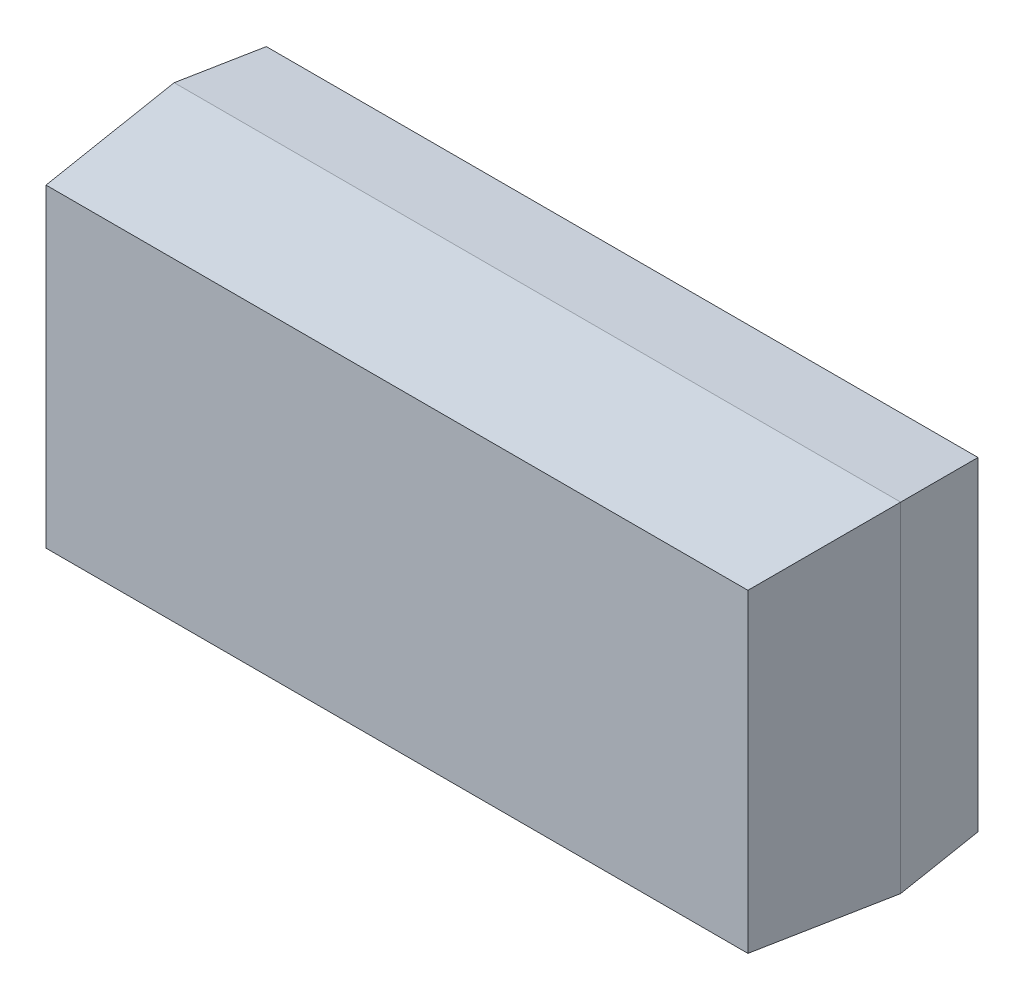
ISO-10303-21;
HEADER;
FILE_DESCRIPTION(('STEP AP214'),'2;1');
FILE_NAME('part.step','',(''),(''),'','','');
FILE_SCHEMA(('AUTOMOTIVE_DESIGN { 1 0 10303 214 1 1 1 1 }'));
ENDSEC;
DATA;
#1=APPLICATION_CONTEXT('core data for automotive mechanical design processes');
#2=APPLICATION_PROTOCOL_DEFINITION('international standard','automotive_design',2000,#1);
#3=PRODUCT_CONTEXT('',#1,'mechanical');
#4=PRODUCT('Part','Part','',(#3));
#5=PRODUCT_RELATED_PRODUCT_CATEGORY('part','',(#4));
#6=PRODUCT_DEFINITION_FORMATION('','',#4);
#7=PRODUCT_DEFINITION_CONTEXT('part definition',#1,'design');
#8=PRODUCT_DEFINITION('design','',#6,#7);
#9=PRODUCT_DEFINITION_SHAPE('','',#8);
#10=(LENGTH_UNIT() NAMED_UNIT(*) SI_UNIT(.MILLI.,.METRE.));
#11=(NAMED_UNIT(*) PLANE_ANGLE_UNIT() SI_UNIT($,.RADIAN.));
#12=(NAMED_UNIT(*) SI_UNIT($,.STERADIAN.) SOLID_ANGLE_UNIT());
#13=UNCERTAINTY_MEASURE_WITH_UNIT(LENGTH_MEASURE(1.E-05),#10,'distance_accuracy_value','');
#14=(GEOMETRIC_REPRESENTATION_CONTEXT(3) GLOBAL_UNCERTAINTY_ASSIGNED_CONTEXT((#13)) GLOBAL_UNIT_ASSIGNED_CONTEXT((#10,
#11,#12)) REPRESENTATION_CONTEXT('',''));
#15=CARTESIAN_POINT('',(0.,0.,0.));
#16=DIRECTION('',(0.,0.,1.));
#17=DIRECTION('',(1.,0.,0.));
#18=AXIS2_PLACEMENT_3D('',#15,#16,#17);
#19=CARTESIAN_POINT('',(0.0749003437265001,-0.478279018165759,0.109451736155931));
#20=DIRECTION('',(0.,0.,-1.));
#21=DIRECTION('',(0.,1.,0.));
#22=AXIS2_PLACEMENT_3D('',#19,#20,#21);
#23=PLANE('',#22);
#24=DIRECTION('',(0.,1.,0.));
#25=VECTOR('',#24,1.);
#26=CARTESIAN_POINT('',(0.194720769231439,-0.41984664680078,0.109451736155931));
#27=LINE('',#26,#25);
#28=CARTESIAN_POINT('',(0.194720769231439,-0.475722889917118,0.109451736155931));
#29=VERTEX_POINT('',#28);
#30=CARTESIAN_POINT('',(0.194720769231439,-0.424600324944285,0.109451736155931));
#31=VERTEX_POINT('',#30);
#32=EDGE_CURVE('E89',#29,#31,#27,.T.);
#33=ORIENTED_EDGE('',*,*,#32,.T.);
#34=DIRECTION('',(1.,0.,0.));
#35=VECTOR('',#34,1.);
#36=CARTESIAN_POINT('',(0.0727027938316369,-0.424600324944284,0.109451736155931));
#37=LINE('',#36,#35);
#38=CARTESIAN_POINT('',(0.0806060782743545,-0.424600324944285,0.109451736155931));
#39=VERTEX_POINT('',#38);
#40=EDGE_CURVE('E71',#31,#39,#37,.F.);
#41=ORIENTED_EDGE('',*,*,#40,.T.);
#42=DIRECTION('',(0.,1.,0.));
#43=VECTOR('',#42,1.);
#44=CARTESIAN_POINT('',(0.0806060782743545,-0.41984664680078,0.109451736155931));
#45=LINE('',#44,#43);
#46=CARTESIAN_POINT('',(0.0806060782743545,-0.475722889917118,0.109451736155931));
#47=VERTEX_POINT('',#46);
#48=EDGE_CURVE('E20',#39,#47,#45,.F.);
#49=ORIENTED_EDGE('',*,*,#48,.T.);
#50=DIRECTION('',(1.,0.,0.));
#51=VECTOR('',#50,1.);
#52=CARTESIAN_POINT('',(0.0727027938316369,-0.475722889917118,0.109451736155931));
#53=LINE('',#52,#51);
#54=EDGE_CURVE('E67',#47,#29,#53,.T.);
#55=ORIENTED_EDGE('',*,*,#54,.T.);
#56=EDGE_LOOP('',(#33,#41,#49,#55));
#57=FACE_BOUND('',#56,.T.);
#58=ADVANCED_FACE('F17',(#57),#23,.F.);
#59=CARTESIAN_POINT('',(0.0785084170110757,-0.41984664680078,0.0854753582031754));
#60=DIRECTION('',(0.996194698091746,0.,-0.0871557427476491));
#61=DIRECTION('',(-0.0871557427476491,0.,-0.996194698091746));
#62=AXIS2_PLACEMENT_3D('',#59,#60,#61);
#63=PLANE('',#62);
#64=DIRECTION('',(0.0868265938642344,0.0868265938642409,0.992432509138969));
#65=VECTOR('',#64,1.);
#66=CARTESIAN_POINT('',(0.0786083056426605,-0.477720662548812,0.08661709048664));
#67=LINE('',#66,#65);
#68=CARTESIAN_POINT('',(0.0786083056426604,-0.477720662548812,0.08661709048664));
#69=VERTEX_POINT('',#68);
#70=EDGE_CURVE('E76',#69,#47,#67,.T.);
#71=ORIENTED_EDGE('',*,*,#70,.T.);
#72=ORIENTED_EDGE('',*,*,#48,.F.);
#73=DIRECTION('',(-0.0868265938642344,0.0868265938642008,-0.992432509138972));
#74=VECTOR('',#73,1.);
#75=CARTESIAN_POINT('',(0.0806060782743545,-0.424600324944284,0.109451736155931));
#76=LINE('',#75,#74);
#77=CARTESIAN_POINT('',(0.0786083056426604,-0.422602552312591,0.08661709048664));
#78=VERTEX_POINT('',#77);
#79=EDGE_CURVE('E91',#39,#78,#76,.T.);
#80=ORIENTED_EDGE('',*,*,#79,.T.);
#81=DIRECTION('',(0.,1.,0.));
#82=VECTOR('',#81,1.);
#83=CARTESIAN_POINT('',(0.0786083056426603,-0.41984664680078,0.08661709048664));
#84=LINE('',#83,#82);
#85=EDGE_CURVE('E85',#78,#69,#84,.F.);
#86=ORIENTED_EDGE('',*,*,#85,.T.);
#87=EDGE_LOOP('',(#71,#72,#80,#86));
#88=FACE_BOUND('',#87,.T.);
#89=ADVANCED_FACE('F84',(#88),#63,.F.);
#90=CARTESIAN_POINT('',(0.0727027938316369,-0.477820551180397,0.0854753582031754));
#91=DIRECTION('',(0.,0.996194698091746,-0.087155742747651));
#92=DIRECTION('',(0.,0.087155742747651,0.996194698091746));
#93=AXIS2_PLACEMENT_3D('',#90,#91,#92);
#94=PLANE('',#93);
#95=DIRECTION('',(-0.0868265938642409,0.0868265938642362,0.992432509138969));
#96=VECTOR('',#95,1.);
#97=CARTESIAN_POINT('',(0.196718541863133,-0.477720662548812,0.08661709048664));
#98=LINE('',#97,#96);
#99=CARTESIAN_POINT('',(0.196718541863133,-0.477720662548812,0.08661709048664));
#100=VERTEX_POINT('',#99);
#101=EDGE_CURVE('E82',#100,#29,#98,.T.);
#102=ORIENTED_EDGE('',*,*,#101,.T.);
#103=ORIENTED_EDGE('',*,*,#54,.F.);
#104=ORIENTED_EDGE('',*,*,#70,.F.);
#105=DIRECTION('',(1.,0.,0.));
#106=VECTOR('',#105,1.);
#107=CARTESIAN_POINT('',(0.0727027938316369,-0.477720662548812,0.08661709048664));
#108=LINE('',#107,#106);
#109=EDGE_CURVE('E101',#69,#100,#108,.T.);
#110=ORIENTED_EDGE('',*,*,#109,.T.);
#111=EDGE_LOOP('',(#102,#103,#104,#110));
#112=FACE_BOUND('',#111,.T.);
#113=ADVANCED_FACE('F79',(#112),#94,.F.);
#114=CARTESIAN_POINT('',(0.194620880599854,-0.41984664680078,0.110593468439396));
#115=DIRECTION('',(-0.996194698091746,0.,-0.0871557427476518));
#116=DIRECTION('',(-0.0871557427476518,0.,0.996194698091746));
#117=AXIS2_PLACEMENT_3D('',#114,#115,#116);
#118=PLANE('',#117);
#119=ORIENTED_EDGE('',*,*,#101,.F.);
#120=DIRECTION('',(0.,1.,0.));
#121=VECTOR('',#120,1.);
#122=CARTESIAN_POINT('',(0.196718541863133,-0.41984664680078,0.08661709048664));
#123=LINE('',#122,#121);
#124=CARTESIAN_POINT('',(0.196718541863133,-0.422602552312591,0.08661709048664));
#125=VERTEX_POINT('',#124);
#126=EDGE_CURVE('E106',#100,#125,#123,.T.);
#127=ORIENTED_EDGE('',*,*,#126,.T.);
#128=DIRECTION('',(-0.0868265938642349,-0.0868265938642008,0.992432509138972));
#129=VECTOR('',#128,1.);
#130=CARTESIAN_POINT('',(0.196718541863133,-0.422602552312591,0.08661709048664));
#131=LINE('',#130,#129);
#132=EDGE_CURVE('E93',#125,#31,#131,.T.);
#133=ORIENTED_EDGE('',*,*,#132,.T.);
#134=ORIENTED_EDGE('',*,*,#32,.F.);
#135=EDGE_LOOP('',(#119,#127,#133,#134));
#136=FACE_BOUND('',#135,.T.);
#137=ADVANCED_FACE('F153',(#136),#118,.F.);
#138=CARTESIAN_POINT('',(0.0727027938316369,-0.424700213575869,0.110593468439396));
#139=DIRECTION('',(0.,-0.99619469809175,-0.0871557427476112));
#140=DIRECTION('',(0.,0.0871557427476112,-0.99619469809175));
#141=AXIS2_PLACEMENT_3D('',#138,#139,#140);
#142=PLANE('',#141);
#143=ORIENTED_EDGE('',*,*,#132,.F.);
#144=DIRECTION('',(1.,0.,0.));
#145=VECTOR('',#144,1.);
#146=CARTESIAN_POINT('',(0.0727027938316369,-0.422602552312591,0.08661709048664));
#147=LINE('',#146,#145);
#148=EDGE_CURVE('E113',#125,#78,#147,.F.);
#149=ORIENTED_EDGE('',*,*,#148,.T.);
#150=ORIENTED_EDGE('',*,*,#79,.F.);
#151=ORIENTED_EDGE('',*,*,#40,.F.);
#152=EDGE_LOOP('',(#143,#149,#150,#151));
#153=FACE_BOUND('',#152,.T.);
#154=ADVANCED_FACE('F150',(#153),#142,.F.);
#155=CARTESIAN_POINT('',(0.0798741357153285,-0.41984664680078,0.072148586549632));
#156=DIRECTION('',(0.996194698091747,0.,0.0871557427476422));
#157=DIRECTION('',(0.0871557427476422,0.,-0.996194698091747));
#158=AXIS2_PLACEMENT_3D('',#155,#156,#157);
#159=PLANE('',#158);
#160=DIRECTION('',(-0.0868265938642208,-0.0868265938642403,0.99243250913897));
#161=VECTOR('',#160,1.);
#162=CARTESIAN_POINT('',(0.0798138580928205,-0.476515110098652,0.0728375629275848));
#163=LINE('',#162,#161);
#164=CARTESIAN_POINT('',(0.0798138580928205,-0.476515110098652,0.0728375629275848));
#165=VERTEX_POINT('',#164);
#166=EDGE_CURVE('E98',#165,#69,#163,.T.);
#167=ORIENTED_EDGE('',*,*,#166,.T.);
#168=ORIENTED_EDGE('',*,*,#85,.F.);
#169=DIRECTION('',(0.0868265938642197,-0.0868265938643095,-0.992432509138964));
#170=VECTOR('',#169,1.);
#171=CARTESIAN_POINT('',(0.0786083056426605,-0.422602552312591,0.08661709048664));
#172=LINE('',#171,#170);
#173=CARTESIAN_POINT('',(0.0798138580928205,-0.423808104762753,0.0728375629275848));
#174=VERTEX_POINT('',#173);
#175=EDGE_CURVE('E109',#78,#174,#172,.T.);
#176=ORIENTED_EDGE('',*,*,#175,.T.);
#177=DIRECTION('',(0.,-1.,0.));
#178=VECTOR('',#177,1.);
#179=CARTESIAN_POINT('',(0.0798138580928205,-0.421172754495958,0.0728375629275848));
#180=LINE('',#179,#178);
#181=EDGE_CURVE('E116',#174,#165,#180,.T.);
#182=ORIENTED_EDGE('',*,*,#181,.T.);
#183=EDGE_LOOP('',(#167,#168,#176,#182));
#184=FACE_BOUND('',#183,.T.);
#185=ADVANCED_FACE('F133',(#184),#159,.F.);
#186=CARTESIAN_POINT('',(0.0727027938316369,-0.476454832476144,0.072148586549632));
#187=DIRECTION('',(0.,0.996194698091746,0.0871557427476517));
#188=DIRECTION('',(0.,-0.0871557427476517,0.996194698091746));
#189=AXIS2_PLACEMENT_3D('',#186,#187,#188);
#190=PLANE('',#189);
#191=ORIENTED_EDGE('',*,*,#166,.F.);
#192=DIRECTION('',(1.,0.,0.));
#193=VECTOR('',#192,1.);
#194=CARTESIAN_POINT('',(0.074028901526813,-0.476515110098652,0.0728375629275848));
#195=LINE('',#194,#193);
#196=CARTESIAN_POINT('',(0.195512989412973,-0.476515110098652,0.0728375629275848));
#197=VERTEX_POINT('',#196);
#198=EDGE_CURVE('E119',#165,#197,#195,.T.);
#199=ORIENTED_EDGE('',*,*,#198,.T.);
#200=DIRECTION('',(0.0868265938642305,-0.0868265938642247,0.992432509138971));
#201=VECTOR('',#200,1.);
#202=CARTESIAN_POINT('',(0.195512989412973,-0.476515110098652,0.0728375629275848));
#203=LINE('',#202,#201);
#204=EDGE_CURVE('E103',#197,#100,#203,.T.);
#205=ORIENTED_EDGE('',*,*,#204,.T.);
#206=ORIENTED_EDGE('',*,*,#109,.F.);
#207=EDGE_LOOP('',(#191,#199,#205,#206));
#208=FACE_BOUND('',#207,.T.);
#209=ADVANCED_FACE('F131',(#208),#190,.F.);
#210=CARTESIAN_POINT('',(0.196778819485641,-0.41984664680078,0.0873060668645927));
#211=DIRECTION('',(-0.996194698091747,0.,0.0871557427476418));
#212=DIRECTION('',(0.0871557427476418,0.,0.996194698091747));
#213=AXIS2_PLACEMENT_3D('',#210,#211,#212);
#214=PLANE('',#213);
#215=ORIENTED_EDGE('',*,*,#204,.F.);
#216=DIRECTION('',(0.,-1.,0.));
#217=VECTOR('',#216,1.);
#218=CARTESIAN_POINT('',(0.195512989412973,-0.421172754495958,0.0728375629275848));
#219=LINE('',#218,#217);
#220=CARTESIAN_POINT('',(0.195512989412973,-0.423808104762753,0.0728375629275848));
#221=VERTEX_POINT('',#220);
#222=EDGE_CURVE('E26',#197,#221,#219,.F.);
#223=ORIENTED_EDGE('',*,*,#222,.T.);
#224=DIRECTION('',(0.0868265938642197,0.0868265938643095,0.992432509138964));
#225=VECTOR('',#224,1.);
#226=CARTESIAN_POINT('',(0.195512989412973,-0.423808104762752,0.0728375629275848));
#227=LINE('',#226,#225);
#228=EDGE_CURVE('E34',#221,#125,#227,.T.);
#229=ORIENTED_EDGE('',*,*,#228,.T.);
#230=ORIENTED_EDGE('',*,*,#126,.F.);
#231=EDGE_LOOP('',(#215,#223,#229,#230));
#232=FACE_BOUND('',#231,.T.);
#233=ADVANCED_FACE('F125',(#232),#214,.F.);
#234=CARTESIAN_POINT('',(0.0727027938316369,-0.422542274690083,0.0873060668645927));
#235=DIRECTION('',(0.,-0.99619469809174,0.0871557427477216));
#236=DIRECTION('',(0.,-0.0871557427477216,-0.99619469809174));
#237=AXIS2_PLACEMENT_3D('',#234,#235,#236);
#238=PLANE('',#237);
#239=ORIENTED_EDGE('',*,*,#228,.F.);
#240=DIRECTION('',(1.,0.,0.));
#241=VECTOR('',#240,1.);
#242=CARTESIAN_POINT('',(0.074028901526813,-0.423808104762753,0.0728375629275848));
#243=LINE('',#242,#241);
#244=EDGE_CURVE('E11',#221,#174,#243,.F.);
#245=ORIENTED_EDGE('',*,*,#244,.T.);
#246=ORIENTED_EDGE('',*,*,#175,.F.);
#247=ORIENTED_EDGE('',*,*,#148,.F.);
#248=EDGE_LOOP('',(#239,#245,#246,#247));
#249=FACE_BOUND('',#248,.T.);
#250=ADVANCED_FACE('F135',(#249),#238,.F.);
#251=CARTESIAN_POINT('',(0.074028901526813,-0.421172754495958,0.0728375629275848));
#252=DIRECTION('',(0.,0.,1.));
#253=DIRECTION('',(0.,-1.,0.));
#254=AXIS2_PLACEMENT_3D('',#251,#252,#253);
#255=PLANE('',#254);
#256=ORIENTED_EDGE('',*,*,#222,.F.);
#257=ORIENTED_EDGE('',*,*,#198,.F.);
#258=ORIENTED_EDGE('',*,*,#181,.F.);
#259=ORIENTED_EDGE('',*,*,#244,.F.);
#260=EDGE_LOOP('',(#256,#257,#258,#259));
#261=FACE_BOUND('',#260,.T.);
#262=ADVANCED_FACE('F129',(#261),#255,.F.);
#263=CLOSED_SHELL('',(#58,#89,#113,#137,#154,#185,#209,#233,#250,#262));
#264=MANIFOLD_SOLID_BREP('B1',#263);
#265=ADVANCED_BREP_SHAPE_REPRESENTATION('',(#18,#264),#14);
#266=SHAPE_DEFINITION_REPRESENTATION(#9,#265);
ENDSEC;
END-ISO-10303-21;
